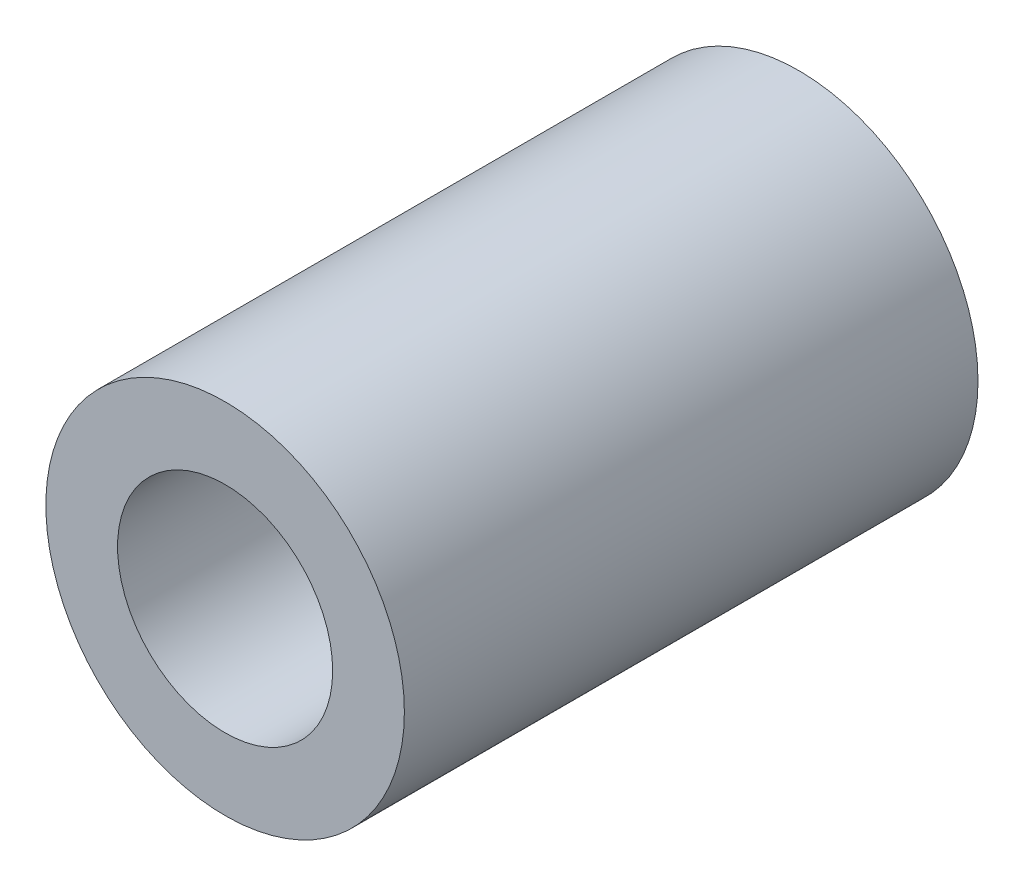
ISO-10303-21;
HEADER;
FILE_DESCRIPTION(('STEP AP214'),'2;1');
FILE_NAME('part.step','',(''),(''),'','','');
FILE_SCHEMA(('AUTOMOTIVE_DESIGN { 1 0 10303 214 1 1 1 1 }'));
ENDSEC;
DATA;
#1=APPLICATION_CONTEXT('core data for automotive mechanical design processes');
#2=APPLICATION_PROTOCOL_DEFINITION('international standard','automotive_design',2000,#1);
#3=PRODUCT_CONTEXT('',#1,'mechanical');
#4=PRODUCT('Part','Part','',(#3));
#5=PRODUCT_RELATED_PRODUCT_CATEGORY('part','',(#4));
#6=PRODUCT_DEFINITION_FORMATION('','',#4);
#7=PRODUCT_DEFINITION_CONTEXT('part definition',#1,'design');
#8=PRODUCT_DEFINITION('design','',#6,#7);
#9=PRODUCT_DEFINITION_SHAPE('','',#8);
#10=(LENGTH_UNIT() NAMED_UNIT(*) SI_UNIT(.MILLI.,.METRE.));
#11=(NAMED_UNIT(*) PLANE_ANGLE_UNIT() SI_UNIT($,.RADIAN.));
#12=(NAMED_UNIT(*) SI_UNIT($,.STERADIAN.) SOLID_ANGLE_UNIT());
#13=UNCERTAINTY_MEASURE_WITH_UNIT(LENGTH_MEASURE(1.E-05),#10,'distance_accuracy_value','');
#14=(GEOMETRIC_REPRESENTATION_CONTEXT(3) GLOBAL_UNCERTAINTY_ASSIGNED_CONTEXT((#13)) GLOBAL_UNIT_ASSIGNED_CONTEXT((#10,
#11,#12)) REPRESENTATION_CONTEXT('',''));
#15=CARTESIAN_POINT('',(0.,0.,0.));
#16=DIRECTION('',(0.,0.,1.));
#17=DIRECTION('',(1.,0.,0.));
#18=AXIS2_PLACEMENT_3D('',#15,#16,#17);
#19=CARTESIAN_POINT('',(0.,0.,8.));
#20=DIRECTION('',(0.,0.,1.));
#21=DIRECTION('',(1.,0.,0.));
#22=AXIS2_PLACEMENT_3D('',#19,#20,#21);
#23=PLANE('',#22);
#24=CARTESIAN_POINT('',(0.,0.,8.));
#25=DIRECTION('',(0.,0.,1.));
#26=DIRECTION('',(1.,0.,0.));
#27=AXIS2_PLACEMENT_3D('',#24,#25,#26);
#28=CIRCLE('',#27,2.5);
#29=CARTESIAN_POINT('',(2.5,0.,8.));
#30=VERTEX_POINT('',#29);
#31=EDGE_CURVE('E10',#30,#30,#28,.T.);
#32=ORIENTED_EDGE('',*,*,#31,.T.);
#33=EDGE_LOOP('',(#32));
#34=FACE_BOUND('',#33,.T.);
#35=CARTESIAN_POINT('',(0.,0.,8.));
#36=DIRECTION('',(0.,0.,1.));
#37=DIRECTION('',(1.,0.,0.));
#38=AXIS2_PLACEMENT_3D('',#35,#36,#37);
#39=CIRCLE('',#38,1.5);
#40=CARTESIAN_POINT('',(1.5,0.,8.));
#41=VERTEX_POINT('',#40);
#42=EDGE_CURVE('E44',#41,#41,#39,.T.);
#43=ORIENTED_EDGE('',*,*,#42,.F.);
#44=EDGE_LOOP('',(#43));
#45=FACE_BOUND('',#44,.T.);
#46=ADVANCED_FACE('F33',(#34,#45),#23,.T.);
#47=CARTESIAN_POINT('',(0.,0.,0.));
#48=DIRECTION('',(0.,0.,1.));
#49=DIRECTION('',(1.,0.,0.));
#50=AXIS2_PLACEMENT_3D('',#47,#48,#49);
#51=PLANE('',#50);
#52=CARTESIAN_POINT('',(0.,0.,0.));
#53=DIRECTION('',(0.,0.,1.));
#54=DIRECTION('',(1.,0.,0.));
#55=AXIS2_PLACEMENT_3D('',#52,#53,#54);
#56=CIRCLE('',#55,2.5);
#57=CARTESIAN_POINT('',(2.5,0.,0.));
#58=VERTEX_POINT('',#57);
#59=EDGE_CURVE('E37',#58,#58,#56,.T.);
#60=ORIENTED_EDGE('',*,*,#59,.F.);
#61=EDGE_LOOP('',(#60));
#62=FACE_BOUND('',#61,.T.);
#63=CARTESIAN_POINT('',(0.,0.,0.));
#64=DIRECTION('',(0.,0.,1.));
#65=DIRECTION('',(1.,0.,0.));
#66=AXIS2_PLACEMENT_3D('',#63,#64,#65);
#67=CIRCLE('',#66,1.5);
#68=CARTESIAN_POINT('',(1.5,0.,0.));
#69=VERTEX_POINT('',#68);
#70=EDGE_CURVE('E46',#69,#69,#67,.T.);
#71=ORIENTED_EDGE('',*,*,#70,.T.);
#72=EDGE_LOOP('',(#71));
#73=FACE_BOUND('',#72,.T.);
#74=ADVANCED_FACE('F56',(#62,#73),#51,.F.);
#75=CARTESIAN_POINT('',(0.,0.,8.));
#76=DIRECTION('',(0.,0.,-1.));
#77=DIRECTION('',(-1.,0.,0.));
#78=AXIS2_PLACEMENT_3D('',#75,#76,#77);
#79=CYLINDRICAL_SURFACE('',#78,2.5);
#80=ORIENTED_EDGE('',*,*,#31,.F.);
#81=EDGE_LOOP('',(#80));
#82=FACE_BOUND('',#81,.T.);
#83=ORIENTED_EDGE('',*,*,#59,.T.);
#84=EDGE_LOOP('',(#83));
#85=FACE_BOUND('',#84,.T.);
#86=ADVANCED_FACE('F35',(#82,#85),#79,.T.);
#87=CARTESIAN_POINT('',(0.,0.,8.));
#88=DIRECTION('',(0.,0.,-1.));
#89=DIRECTION('',(-1.,0.,0.));
#90=AXIS2_PLACEMENT_3D('',#87,#88,#89);
#91=CYLINDRICAL_SURFACE('',#90,1.5);
#92=ORIENTED_EDGE('',*,*,#42,.T.);
#93=EDGE_LOOP('',(#92));
#94=FACE_BOUND('',#93,.T.);
#95=ORIENTED_EDGE('',*,*,#70,.F.);
#96=EDGE_LOOP('',(#95));
#97=FACE_BOUND('',#96,.T.);
#98=ADVANCED_FACE('F52',(#94,#97),#91,.F.);
#99=CLOSED_SHELL('',(#46,#74,#86,#98));
#100=MANIFOLD_SOLID_BREP('B2',#99);
#101=ADVANCED_BREP_SHAPE_REPRESENTATION('',(#18,#100),#14);
#102=SHAPE_DEFINITION_REPRESENTATION(#9,#101);
ENDSEC;
END-ISO-10303-21;
